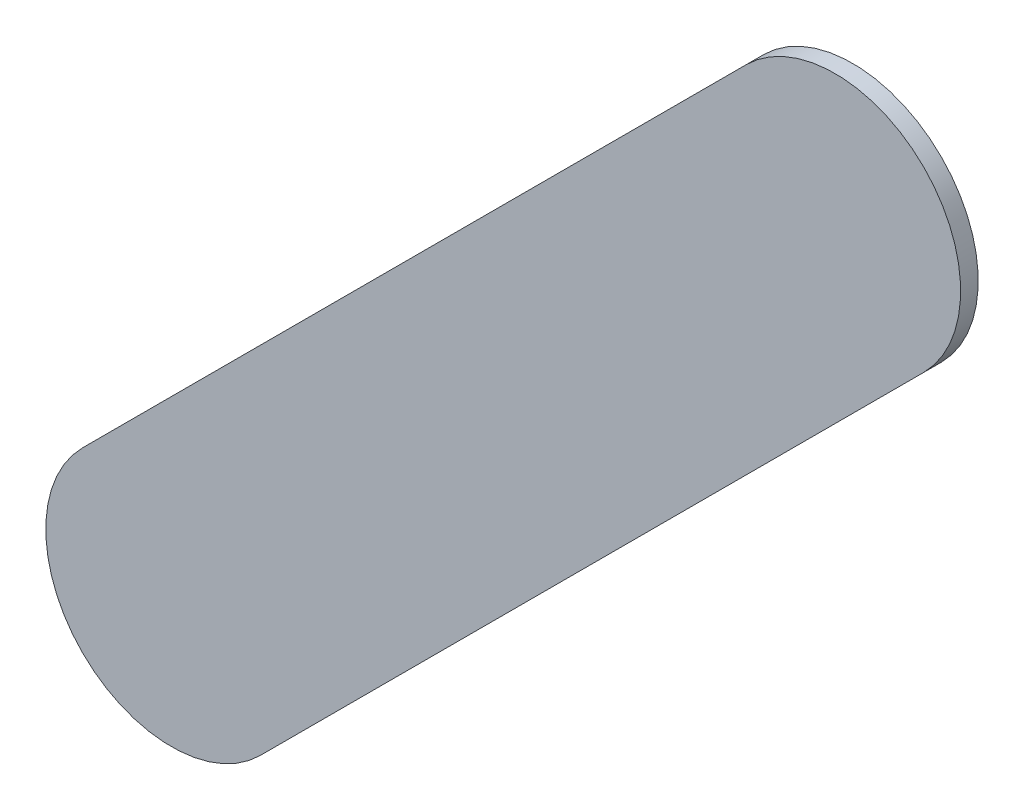
ISO-10303-21;
HEADER;
FILE_DESCRIPTION(('STEP AP214'),'2;1');
FILE_NAME('part.step','',(''),(''),'','','');
FILE_SCHEMA(('AUTOMOTIVE_DESIGN { 1 0 10303 214 1 1 1 1 }'));
ENDSEC;
DATA;
#1=APPLICATION_CONTEXT('core data for automotive mechanical design processes');
#2=APPLICATION_PROTOCOL_DEFINITION('international standard','automotive_design',2000,#1);
#3=PRODUCT_CONTEXT('',#1,'mechanical');
#4=PRODUCT('Part','Part','',(#3));
#5=PRODUCT_RELATED_PRODUCT_CATEGORY('part','',(#4));
#6=PRODUCT_DEFINITION_FORMATION('','',#4);
#7=PRODUCT_DEFINITION_CONTEXT('part definition',#1,'design');
#8=PRODUCT_DEFINITION('design','',#6,#7);
#9=PRODUCT_DEFINITION_SHAPE('','',#8);
#10=(LENGTH_UNIT() NAMED_UNIT(*) SI_UNIT(.MILLI.,.METRE.));
#11=(NAMED_UNIT(*) PLANE_ANGLE_UNIT() SI_UNIT($,.RADIAN.));
#12=(NAMED_UNIT(*) SI_UNIT($,.STERADIAN.) SOLID_ANGLE_UNIT());
#13=UNCERTAINTY_MEASURE_WITH_UNIT(LENGTH_MEASURE(1.E-05),#10,'distance_accuracy_value','');
#14=(GEOMETRIC_REPRESENTATION_CONTEXT(3) GLOBAL_UNCERTAINTY_ASSIGNED_CONTEXT((#13)) GLOBAL_UNIT_ASSIGNED_CONTEXT((#10,
#11,#12)) REPRESENTATION_CONTEXT('',''));
#15=CARTESIAN_POINT('',(0.,0.,0.));
#16=DIRECTION('',(0.,0.,1.));
#17=DIRECTION('',(1.,0.,0.));
#18=AXIS2_PLACEMENT_3D('',#15,#16,#17);
#19=CARTESIAN_POINT('',(146.127223,-74.702423,0.));
#20=DIRECTION('',(0.,0.,1.));
#21=DIRECTION('',(1.,0.,0.));
#22=AXIS2_PLACEMENT_3D('',#19,#20,#21);
#23=PLANE('',#22);
#24=DIRECTION('',(-0.707106781186548,-0.707106781186548,0.));
#25=VECTOR('',#24,1.);
#26=CARTESIAN_POINT('',(146.127223,-74.702423,0.));
#27=LINE('',#26,#25);
#28=CARTESIAN_POINT('',(146.127223,-74.702423,0.));
#29=VERTEX_POINT('',#28);
#30=CARTESIAN_POINT('',(144.806423,-76.023223,0.));
#31=VERTEX_POINT('',#30);
#32=EDGE_CURVE('E82',#29,#31,#27,.T.);
#33=ORIENTED_EDGE('',*,*,#32,.T.);
#34=CARTESIAN_POINT('',(144.9831995,-76.1999995,0.));
#35=DIRECTION('',(0.,0.,1.));
#36=DIRECTION('',(-0.707106781186548,0.707106781186548,0.));
#37=AXIS2_PLACEMENT_3D('',#34,#35,#36);
#38=CIRCLE('',#37,0.249999723809);
#39=CARTESIAN_POINT('',(145.159976,-76.376776,0.));
#40=VERTEX_POINT('',#39);
#41=EDGE_CURVE('E108',#31,#40,#38,.T.);
#42=ORIENTED_EDGE('',*,*,#41,.T.);
#43=DIRECTION('',(0.707106781186548,0.707106781186548,0.));
#44=VECTOR('',#43,1.);
#45=CARTESIAN_POINT('',(145.159976,-76.376776,0.));
#46=LINE('',#45,#44);
#47=CARTESIAN_POINT('',(146.480776,-75.055976,0.));
#48=VERTEX_POINT('',#47);
#49=EDGE_CURVE('E75',#40,#48,#46,.T.);
#50=ORIENTED_EDGE('',*,*,#49,.T.);
#51=CARTESIAN_POINT('',(146.3039995,-74.8791995,0.));
#52=DIRECTION('',(0.,0.,1.));
#53=DIRECTION('',(0.707106781186548,-0.707106781186548,0.));
#54=AXIS2_PLACEMENT_3D('',#51,#52,#53);
#55=CIRCLE('',#54,0.249999723809);
#56=EDGE_CURVE('E11',#48,#29,#55,.T.);
#57=ORIENTED_EDGE('',*,*,#56,.T.);
#58=EDGE_LOOP('',(#33,#42,#50,#57));
#59=FACE_BOUND('',#58,.T.);
#60=ADVANCED_FACE('F17',(#59),#23,.T.);
#61=CARTESIAN_POINT('',(146.127223,-74.702423,-0.035));
#62=DIRECTION('',(0.,0.,1.));
#63=DIRECTION('',(1.,0.,0.));
#64=AXIS2_PLACEMENT_3D('',#61,#62,#63);
#65=PLANE('',#64);
#66=CARTESIAN_POINT('',(146.3039995,-74.8791995,-0.035));
#67=DIRECTION('',(0.,0.,1.));
#68=DIRECTION('',(0.707106781186548,-0.707106781186548,0.));
#69=AXIS2_PLACEMENT_3D('',#66,#67,#68);
#70=CIRCLE('',#69,0.249999723809);
#71=CARTESIAN_POINT('',(146.480776,-75.055976,-0.035));
#72=VERTEX_POINT('',#71);
#73=CARTESIAN_POINT('',(146.127223,-74.702423,-0.035));
#74=VERTEX_POINT('',#73);
#75=EDGE_CURVE('E26',#72,#74,#70,.T.);
#76=ORIENTED_EDGE('',*,*,#75,.F.);
#77=DIRECTION('',(0.707106781186548,0.707106781186548,0.));
#78=VECTOR('',#77,1.);
#79=CARTESIAN_POINT('',(145.159976,-76.376776,-0.035));
#80=LINE('',#79,#78);
#81=CARTESIAN_POINT('',(145.159976,-76.376776,-0.035));
#82=VERTEX_POINT('',#81);
#83=EDGE_CURVE('E112',#82,#72,#80,.T.);
#84=ORIENTED_EDGE('',*,*,#83,.F.);
#85=CARTESIAN_POINT('',(144.9831995,-76.1999995,-0.035));
#86=DIRECTION('',(0.,0.,1.));
#87=DIRECTION('',(-0.707106781186548,0.707106781186548,0.));
#88=AXIS2_PLACEMENT_3D('',#85,#86,#87);
#89=CIRCLE('',#88,0.249999723809);
#90=CARTESIAN_POINT('',(144.806423,-76.023223,-0.035));
#91=VERTEX_POINT('',#90);
#92=EDGE_CURVE('E84',#91,#82,#89,.T.);
#93=ORIENTED_EDGE('',*,*,#92,.F.);
#94=DIRECTION('',(-0.707106781186548,-0.707106781186548,0.));
#95=VECTOR('',#94,1.);
#96=CARTESIAN_POINT('',(146.127223,-74.702423,-0.035));
#97=LINE('',#96,#95);
#98=EDGE_CURVE('E80',#74,#91,#97,.T.);
#99=ORIENTED_EDGE('',*,*,#98,.F.);
#100=EDGE_LOOP('',(#76,#84,#93,#99));
#101=FACE_BOUND('',#100,.T.);
#102=ADVANCED_FACE('F86',(#101),#65,.F.);
#103=CARTESIAN_POINT('',(146.3039995,-74.8791995,-0.035));
#104=DIRECTION('',(0.,0.,-1.));
#105=DIRECTION('',(0.707106781186548,-0.707106781186548,0.));
#106=AXIS2_PLACEMENT_3D('',#103,#104,#105);
#107=CYLINDRICAL_SURFACE('',#106,0.249999723809);
#108=ORIENTED_EDGE('',*,*,#75,.T.);
#109=DIRECTION('',(0.,0.,1.));
#110=VECTOR('',#109,1.);
#111=CARTESIAN_POINT('',(146.127223,-74.702423,-0.035));
#112=LINE('',#111,#110);
#113=EDGE_CURVE('E70',#74,#29,#112,.T.);
#114=ORIENTED_EDGE('',*,*,#113,.T.);
#115=ORIENTED_EDGE('',*,*,#56,.F.);
#116=DIRECTION('',(0.,0.,1.));
#117=VECTOR('',#116,1.);
#118=CARTESIAN_POINT('',(146.480776,-75.055976,-0.035));
#119=LINE('',#118,#117);
#120=EDGE_CURVE('E20',#72,#48,#119,.T.);
#121=ORIENTED_EDGE('',*,*,#120,.F.);
#122=EDGE_LOOP('',(#108,#114,#115,#121));
#123=FACE_BOUND('',#122,.T.);
#124=ADVANCED_FACE('F69',(#123),#107,.T.);
#125=CARTESIAN_POINT('',(145.159976,-76.376776,-0.035));
#126=DIRECTION('',(-0.707106781186548,0.707106781186548,0.));
#127=DIRECTION('',(0.,0.,1.));
#128=AXIS2_PLACEMENT_3D('',#125,#126,#127);
#129=PLANE('',#128);
#130=ORIENTED_EDGE('',*,*,#83,.T.);
#131=ORIENTED_EDGE('',*,*,#120,.T.);
#132=ORIENTED_EDGE('',*,*,#49,.F.);
#133=DIRECTION('',(0.,0.,1.));
#134=VECTOR('',#133,1.);
#135=CARTESIAN_POINT('',(145.159976,-76.376776,-0.035));
#136=LINE('',#135,#134);
#137=EDGE_CURVE('E104',#82,#40,#136,.T.);
#138=ORIENTED_EDGE('',*,*,#137,.F.);
#139=EDGE_LOOP('',(#130,#131,#132,#138));
#140=FACE_BOUND('',#139,.T.);
#141=ADVANCED_FACE('F121',(#140),#129,.F.);
#142=CARTESIAN_POINT('',(144.9831995,-76.1999995,-0.035));
#143=DIRECTION('',(0.,0.,-1.));
#144=DIRECTION('',(-0.707106781186548,0.707106781186548,0.));
#145=AXIS2_PLACEMENT_3D('',#142,#143,#144);
#146=CYLINDRICAL_SURFACE('',#145,0.249999723809);
#147=ORIENTED_EDGE('',*,*,#92,.T.);
#148=ORIENTED_EDGE('',*,*,#137,.T.);
#149=ORIENTED_EDGE('',*,*,#41,.F.);
#150=DIRECTION('',(0.,0.,1.));
#151=VECTOR('',#150,1.);
#152=CARTESIAN_POINT('',(144.806423,-76.023223,-0.035));
#153=LINE('',#152,#151);
#154=EDGE_CURVE('E90',#91,#31,#153,.T.);
#155=ORIENTED_EDGE('',*,*,#154,.F.);
#156=EDGE_LOOP('',(#147,#148,#149,#155));
#157=FACE_BOUND('',#156,.T.);
#158=ADVANCED_FACE('F124',(#157),#146,.T.);
#159=CARTESIAN_POINT('',(146.127223,-74.702423,-0.035));
#160=DIRECTION('',(0.707106781186548,-0.707106781186548,0.));
#161=DIRECTION('',(0.,0.,-1.));
#162=AXIS2_PLACEMENT_3D('',#159,#160,#161);
#163=PLANE('',#162);
#164=ORIENTED_EDGE('',*,*,#98,.T.);
#165=ORIENTED_EDGE('',*,*,#154,.T.);
#166=ORIENTED_EDGE('',*,*,#32,.F.);
#167=ORIENTED_EDGE('',*,*,#113,.F.);
#168=EDGE_LOOP('',(#164,#165,#166,#167));
#169=FACE_BOUND('',#168,.T.);
#170=ADVANCED_FACE('F78',(#169),#163,.F.);
#171=CLOSED_SHELL('',(#60,#102,#124,#141,#158,#170));
#172=MANIFOLD_SOLID_BREP('B1',#171);
#173=ADVANCED_BREP_SHAPE_REPRESENTATION('',(#18,#172),#14);
#174=SHAPE_DEFINITION_REPRESENTATION(#9,#173);
ENDSEC;
END-ISO-10303-21;
